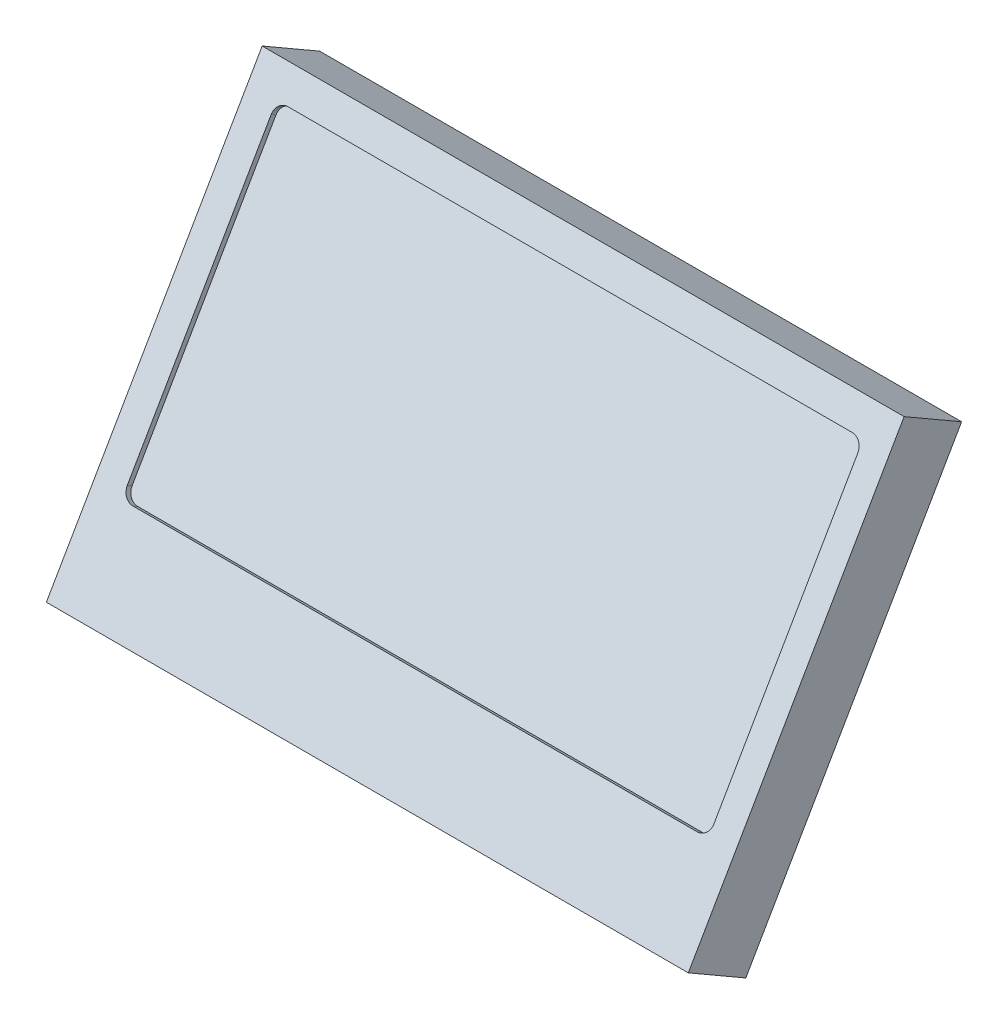
ISO-10303-21;
HEADER;
FILE_DESCRIPTION(('STEP AP214'),'2;1');
FILE_NAME('part.step','',(''),(''),'','','');
FILE_SCHEMA(('AUTOMOTIVE_DESIGN { 1 0 10303 214 1 1 1 1 }'));
ENDSEC;
DATA;
#1=APPLICATION_CONTEXT('core data for automotive mechanical design processes');
#2=APPLICATION_PROTOCOL_DEFINITION('international standard','automotive_design',2000,#1);
#3=PRODUCT_CONTEXT('',#1,'mechanical');
#4=PRODUCT('Part','Part','',(#3));
#5=PRODUCT_RELATED_PRODUCT_CATEGORY('part','',(#4));
#6=PRODUCT_DEFINITION_FORMATION('','',#4);
#7=PRODUCT_DEFINITION_CONTEXT('part definition',#1,'design');
#8=PRODUCT_DEFINITION('design','',#6,#7);
#9=PRODUCT_DEFINITION_SHAPE('','',#8);
#10=(LENGTH_UNIT() NAMED_UNIT(*) SI_UNIT(.MILLI.,.METRE.));
#11=(NAMED_UNIT(*) PLANE_ANGLE_UNIT() SI_UNIT($,.RADIAN.));
#12=(NAMED_UNIT(*) SI_UNIT($,.STERADIAN.) SOLID_ANGLE_UNIT());
#13=UNCERTAINTY_MEASURE_WITH_UNIT(LENGTH_MEASURE(1.E-05),#10,'distance_accuracy_value','');
#14=(GEOMETRIC_REPRESENTATION_CONTEXT(3) GLOBAL_UNCERTAINTY_ASSIGNED_CONTEXT((#13)) GLOBAL_UNIT_ASSIGNED_CONTEXT((#10,
#11,#12)) REPRESENTATION_CONTEXT('',''));
#15=CARTESIAN_POINT('',(0.,0.,0.));
#16=DIRECTION('',(0.,0.,1.));
#17=DIRECTION('',(1.,0.,0.));
#18=AXIS2_PLACEMENT_3D('',#15,#16,#17);
#19=CARTESIAN_POINT('',(42.625,36.0009193510513,16.1708302491977));
#20=DIRECTION('',(0.,-0.5,-0.866025403784439));
#21=DIRECTION('',(0.,0.866025403784439,-0.5));
#22=AXIS2_PLACEMENT_3D('',#19,#20,#21);
#23=PLANE('',#22);
#24=DIRECTION('',(1.,0.,0.));
#25=VECTOR('',#24,1.);
#26=CARTESIAN_POINT('',(69.125,23.8765636980692,23.1708302491977));
#27=LINE('',#26,#25);
#28=CARTESIAN_POINT('',(17.125,23.8765636980692,23.1708302491977));
#29=VERTEX_POINT('',#28);
#30=CARTESIAN_POINT('',(68.125,23.8765636980692,23.1708302491977));
#31=VERTEX_POINT('',#30);
#32=EDGE_CURVE('E165',#29,#31,#27,.T.);
#33=ORIENTED_EDGE('',*,*,#32,.T.);
#34=CARTESIAN_POINT('',(68.125,24.7425891018536,22.6708302491977));
#35=DIRECTION('',(0.,-0.5,-0.866025403784439));
#36=DIRECTION('',(0.,0.866025403784439,-0.5));
#37=AXIS2_PLACEMENT_3D('',#34,#35,#36);
#38=CIRCLE('',#37,1.);
#39=CARTESIAN_POINT('',(69.125,24.7425891018536,22.6708302491977));
#40=VERTEX_POINT('',#39);
#41=EDGE_CURVE('E129',#31,#40,#38,.F.);
#42=ORIENTED_EDGE('',*,*,#41,.T.);
#43=DIRECTION('',(0.,0.866025403784439,-0.5));
#44=VECTOR('',#43,1.);
#45=CARTESIAN_POINT('',(69.125,24.7425891018536,22.6708302491977));
#46=LINE('',#45,#44);
#47=CARTESIAN_POINT('',(69.125,47.259249600249,9.6708302491977));
#48=VERTEX_POINT('',#47);
#49=EDGE_CURVE('E126',#40,#48,#46,.T.);
#50=ORIENTED_EDGE('',*,*,#49,.T.);
#51=CARTESIAN_POINT('',(68.125,47.259249600249,9.6708302491977));
#52=DIRECTION('',(0.,-0.5,-0.866025403784439));
#53=DIRECTION('',(0.,0.866025403784439,-0.5));
#54=AXIS2_PLACEMENT_3D('',#51,#52,#53);
#55=CIRCLE('',#54,1.);
#56=CARTESIAN_POINT('',(68.125,48.1252750040335,9.17083024919768));
#57=VERTEX_POINT('',#56);
#58=EDGE_CURVE('E20',#57,#48,#55,.T.);
#59=ORIENTED_EDGE('',*,*,#58,.F.);
#60=DIRECTION('',(1.,0.,0.));
#61=VECTOR('',#60,1.);
#62=CARTESIAN_POINT('',(16.125,48.1252750040335,9.17083024919766));
#63=LINE('',#62,#61);
#64=CARTESIAN_POINT('',(17.125,48.1252750040335,9.17083024919766));
#65=VERTEX_POINT('',#64);
#66=EDGE_CURVE('E146',#57,#65,#63,.F.);
#67=ORIENTED_EDGE('',*,*,#66,.T.);
#68=CARTESIAN_POINT('',(17.125,47.259249600249,9.67083024919768));
#69=DIRECTION('',(0.,-0.5,-0.866025403784439));
#70=DIRECTION('',(0.,0.866025403784439,-0.5));
#71=AXIS2_PLACEMENT_3D('',#68,#69,#70);
#72=CIRCLE('',#71,1.);
#73=CARTESIAN_POINT('',(16.125,47.259249600249,9.67083024919769));
#74=VERTEX_POINT('',#73);
#75=EDGE_CURVE('E150',#65,#74,#72,.F.);
#76=ORIENTED_EDGE('',*,*,#75,.T.);
#77=DIRECTION('',(0.,-0.866025403784439,0.5));
#78=VECTOR('',#77,1.);
#79=CARTESIAN_POINT('',(16.125,47.259249600249,9.67083024919771));
#80=LINE('',#79,#78);
#81=CARTESIAN_POINT('',(16.125,24.7425891018536,22.6708302491977));
#82=VERTEX_POINT('',#81);
#83=EDGE_CURVE('E155',#74,#82,#80,.T.);
#84=ORIENTED_EDGE('',*,*,#83,.T.);
#85=CARTESIAN_POINT('',(17.125,24.7425891018536,22.6708302491977));
#86=DIRECTION('',(0.,-0.5,-0.866025403784439));
#87=DIRECTION('',(0.,0.866025403784439,-0.5));
#88=AXIS2_PLACEMENT_3D('',#85,#86,#87);
#89=CIRCLE('',#88,1.);
#90=EDGE_CURVE('E160',#82,#29,#89,.F.);
#91=ORIENTED_EDGE('',*,*,#90,.T.);
#92=EDGE_LOOP('',(#33,#42,#50,#59,#67,#76,#84,#91));
#93=FACE_BOUND('',#92,.T.);
#94=ADVANCED_FACE('F17',(#93),#23,.F.);
#95=CARTESIAN_POINT('',(69.125,48.3752750040335,9.60384295108993));
#96=DIRECTION('',(1.,0.,0.));
#97=DIRECTION('',(0.,0.,-1.));
#98=AXIS2_PLACEMENT_3D('',#95,#96,#97);
#99=PLANE('',#98);
#100=ORIENTED_EDGE('',*,*,#49,.F.);
#101=DIRECTION('',(0.,-0.5,-0.866025403784439));
#102=VECTOR('',#101,1.);
#103=CARTESIAN_POINT('',(69.125,24.9925891018536,23.1038429510899));
#104=LINE('',#103,#102);
#105=CARTESIAN_POINT('',(69.125,24.9925891018536,23.1038429510899));
#106=VERTEX_POINT('',#105);
#107=EDGE_CURVE('E133',#40,#106,#104,.F.);
#108=ORIENTED_EDGE('',*,*,#107,.T.);
#109=DIRECTION('',(0.,-0.866025403784439,0.5));
#110=VECTOR('',#109,1.);
#111=CARTESIAN_POINT('',(69.125,33.761096315171,18.0413429510899));
#112=LINE('',#111,#110);
#113=CARTESIAN_POINT('',(69.125,47.509249600249,10.1038429510899));
#114=VERTEX_POINT('',#113);
#115=EDGE_CURVE('E137',#114,#106,#112,.T.);
#116=ORIENTED_EDGE('',*,*,#115,.F.);
#117=DIRECTION('',(0.,-0.5,-0.866025403784439));
#118=VECTOR('',#117,1.);
#119=CARTESIAN_POINT('',(69.125,47.509249600249,10.1038429510899));
#120=LINE('',#119,#118);
#121=EDGE_CURVE('E122',#114,#48,#120,.T.);
#122=ORIENTED_EDGE('',*,*,#121,.T.);
#123=EDGE_LOOP('',(#100,#108,#116,#122));
#124=FACE_BOUND('',#123,.T.);
#125=ADVANCED_FACE('F136',(#124),#99,.F.);
#126=CARTESIAN_POINT('',(68.125,24.9925891018536,23.1038429510899));
#127=DIRECTION('',(0.,-0.5,-0.866025403784439));
#128=DIRECTION('',(0.,0.866025403784439,-0.5));
#129=AXIS2_PLACEMENT_3D('',#126,#127,#128);
#130=CYLINDRICAL_SURFACE('',#129,1.);
#131=DIRECTION('',(0.,-0.5,-0.866025403784439));
#132=VECTOR('',#131,1.);
#133=CARTESIAN_POINT('',(68.125,24.1265636980692,23.6038429510899));
#134=LINE('',#133,#132);
#135=CARTESIAN_POINT('',(68.125,24.1265636980692,23.6038429510899));
#136=VERTEX_POINT('',#135);
#137=EDGE_CURVE('E161',#31,#136,#134,.F.);
#138=ORIENTED_EDGE('',*,*,#137,.T.);
#139=CARTESIAN_POINT('',(68.125,24.9925891018536,23.1038429510899));
#140=DIRECTION('',(0.,-0.5,-0.866025403784439));
#141=DIRECTION('',(0.,0.866025403784439,-0.5));
#142=AXIS2_PLACEMENT_3D('',#139,#140,#141);
#143=CIRCLE('',#142,1.);
#144=EDGE_CURVE('E139',#106,#136,#143,.T.);
#145=ORIENTED_EDGE('',*,*,#144,.F.);
#146=ORIENTED_EDGE('',*,*,#107,.F.);
#147=ORIENTED_EDGE('',*,*,#41,.F.);
#148=EDGE_LOOP('',(#138,#145,#146,#147));
#149=FACE_BOUND('',#148,.T.);
#150=ADVANCED_FACE('F257',(#149),#130,.F.);
#151=CARTESIAN_POINT('',(69.125,24.1265636980692,23.6038429510899));
#152=DIRECTION('',(0.,-0.866025403784439,0.5));
#153=DIRECTION('',(0.,-0.5,-0.866025403784439));
#154=AXIS2_PLACEMENT_3D('',#151,#152,#153);
#155=PLANE('',#154);
#156=DIRECTION('',(1.,0.,0.));
#157=VECTOR('',#156,1.);
#158=CARTESIAN_POINT('',(42.5,24.1265636980692,23.6038429510899));
#159=LINE('',#158,#157);
#160=CARTESIAN_POINT('',(17.125,24.1265636980692,23.6038429510899));
#161=VERTEX_POINT('',#160);
#162=EDGE_CURVE('E184',#136,#161,#159,.F.);
#163=ORIENTED_EDGE('',*,*,#162,.F.);
#164=ORIENTED_EDGE('',*,*,#137,.F.);
#165=ORIENTED_EDGE('',*,*,#32,.F.);
#166=DIRECTION('',(0.,-0.5,-0.866025403784439));
#167=VECTOR('',#166,1.);
#168=CARTESIAN_POINT('',(17.125,24.1265636980692,23.6038429510899));
#169=LINE('',#168,#167);
#170=EDGE_CURVE('E156',#29,#161,#169,.F.);
#171=ORIENTED_EDGE('',*,*,#170,.T.);
#172=EDGE_LOOP('',(#163,#164,#165,#171));
#173=FACE_BOUND('',#172,.T.);
#174=ADVANCED_FACE('F254',(#173),#155,.F.);
#175=CARTESIAN_POINT('',(17.125,24.9925891018536,23.1038429510899));
#176=DIRECTION('',(0.,-0.5,-0.866025403784439));
#177=DIRECTION('',(0.,0.866025403784439,-0.5));
#178=AXIS2_PLACEMENT_3D('',#175,#176,#177);
#179=CYLINDRICAL_SURFACE('',#178,1.);
#180=DIRECTION('',(0.,0.500000000000017,0.866025403784429));
#181=VECTOR('',#180,1.);
#182=CARTESIAN_POINT('',(16.125,24.7425891018536,22.6708302491977));
#183=LINE('',#182,#181);
#184=CARTESIAN_POINT('',(16.125,24.9925891018536,23.1038429510899));
#185=VERTEX_POINT('',#184);
#186=EDGE_CURVE('E151',#82,#185,#183,.T.);
#187=ORIENTED_EDGE('',*,*,#186,.T.);
#188=CARTESIAN_POINT('',(17.125,24.9925891018536,23.1038429510899));
#189=DIRECTION('',(0.,-0.5,-0.866025403784439));
#190=DIRECTION('',(0.,0.866025403784439,-0.5));
#191=AXIS2_PLACEMENT_3D('',#188,#189,#190);
#192=CIRCLE('',#191,1.);
#193=EDGE_CURVE('E181',#161,#185,#192,.T.);
#194=ORIENTED_EDGE('',*,*,#193,.F.);
#195=ORIENTED_EDGE('',*,*,#170,.F.);
#196=ORIENTED_EDGE('',*,*,#90,.F.);
#197=EDGE_LOOP('',(#187,#194,#195,#196));
#198=FACE_BOUND('',#197,.T.);
#199=ADVANCED_FACE('F249',(#198),#179,.F.);
#200=CARTESIAN_POINT('',(16.125,24.1265636980692,23.6038429510899));
#201=DIRECTION('',(-1.,0.,0.));
#202=DIRECTION('',(0.,0.,1.));
#203=AXIS2_PLACEMENT_3D('',#200,#201,#202);
#204=PLANE('',#203);
#205=ORIENTED_EDGE('',*,*,#83,.F.);
#206=DIRECTION('',(0.,-0.5,-0.866025403784439));
#207=VECTOR('',#206,1.);
#208=CARTESIAN_POINT('',(16.125,47.509249600249,10.1038429510899));
#209=LINE('',#208,#207);
#210=CARTESIAN_POINT('',(16.125,47.509249600249,10.1038429510899));
#211=VERTEX_POINT('',#210);
#212=EDGE_CURVE('E147',#74,#211,#209,.F.);
#213=ORIENTED_EDGE('',*,*,#212,.T.);
#214=DIRECTION('',(0.,-0.866025403784439,0.5));
#215=VECTOR('',#214,1.);
#216=CARTESIAN_POINT('',(16.125,33.761096315171,18.0413429510899));
#217=LINE('',#216,#215);
#218=EDGE_CURVE('E180',#185,#211,#217,.F.);
#219=ORIENTED_EDGE('',*,*,#218,.F.);
#220=ORIENTED_EDGE('',*,*,#186,.F.);
#221=EDGE_LOOP('',(#205,#213,#219,#220));
#222=FACE_BOUND('',#221,.T.);
#223=ADVANCED_FACE('F245',(#222),#204,.F.);
#224=CARTESIAN_POINT('',(17.125,47.509249600249,10.1038429510899));
#225=DIRECTION('',(0.,-0.5,-0.866025403784439));
#226=DIRECTION('',(0.,0.866025403784439,-0.5));
#227=AXIS2_PLACEMENT_3D('',#224,#225,#226);
#228=CYLINDRICAL_SURFACE('',#227,1.);
#229=DIRECTION('',(0.,0.5,0.866025403784439));
#230=VECTOR('',#229,1.);
#231=CARTESIAN_POINT('',(17.125,48.3752750040335,9.60384295108993));
#232=LINE('',#231,#230);
#233=CARTESIAN_POINT('',(17.125,48.3752750040335,9.60384295108988));
#234=VERTEX_POINT('',#233);
#235=EDGE_CURVE('E141',#65,#234,#232,.T.);
#236=ORIENTED_EDGE('',*,*,#235,.T.);
#237=CARTESIAN_POINT('',(17.125,47.509249600249,10.1038429510899));
#238=DIRECTION('',(0.,-0.5,-0.866025403784439));
#239=DIRECTION('',(0.,0.866025403784439,-0.5));
#240=AXIS2_PLACEMENT_3D('',#237,#238,#239);
#241=CIRCLE('',#240,1.);
#242=EDGE_CURVE('E178',#211,#234,#241,.T.);
#243=ORIENTED_EDGE('',*,*,#242,.F.);
#244=ORIENTED_EDGE('',*,*,#212,.F.);
#245=ORIENTED_EDGE('',*,*,#75,.F.);
#246=EDGE_LOOP('',(#236,#243,#244,#245));
#247=FACE_BOUND('',#246,.T.);
#248=ADVANCED_FACE('F242',(#247),#228,.F.);
#249=CARTESIAN_POINT('',(16.125,48.3752750040335,9.60384295108993));
#250=DIRECTION('',(0.,0.866025403784439,-0.5));
#251=DIRECTION('',(0.,0.5,0.866025403784439));
#252=AXIS2_PLACEMENT_3D('',#249,#250,#251);
#253=PLANE('',#252);
#254=ORIENTED_EDGE('',*,*,#66,.F.);
#255=DIRECTION('',(0.,-0.5,-0.866025403784439));
#256=VECTOR('',#255,1.);
#257=CARTESIAN_POINT('',(68.125,48.3752750040334,9.6038429510899));
#258=LINE('',#257,#256);
#259=CARTESIAN_POINT('',(68.125,48.3752750040335,9.60384295108991));
#260=VERTEX_POINT('',#259);
#261=EDGE_CURVE('E125',#57,#260,#258,.F.);
#262=ORIENTED_EDGE('',*,*,#261,.T.);
#263=DIRECTION('',(1.,0.,0.));
#264=VECTOR('',#263,1.);
#265=CARTESIAN_POINT('',(42.5,48.3752750040335,9.60384295108987));
#266=LINE('',#265,#264);
#267=EDGE_CURVE('E177',#234,#260,#266,.T.);
#268=ORIENTED_EDGE('',*,*,#267,.F.);
#269=ORIENTED_EDGE('',*,*,#235,.F.);
#270=EDGE_LOOP('',(#254,#262,#268,#269));
#271=FACE_BOUND('',#270,.T.);
#272=ADVANCED_FACE('F239',(#271),#253,.F.);
#273=CARTESIAN_POINT('',(68.125,47.509249600249,10.1038429510899));
#274=DIRECTION('',(0.,-0.5,-0.866025403784439));
#275=DIRECTION('',(0.,0.866025403784439,-0.5));
#276=AXIS2_PLACEMENT_3D('',#273,#274,#275);
#277=CYLINDRICAL_SURFACE('',#276,1.);
#278=ORIENTED_EDGE('',*,*,#121,.F.);
#279=CARTESIAN_POINT('',(68.125,47.509249600249,10.1038429510899));
#280=DIRECTION('',(0.,-0.5,-0.866025403784439));
#281=DIRECTION('',(0.,0.866025403784439,-0.5));
#282=AXIS2_PLACEMENT_3D('',#279,#280,#281);
#283=CIRCLE('',#282,1.);
#284=EDGE_CURVE('E174',#260,#114,#283,.T.);
#285=ORIENTED_EDGE('',*,*,#284,.F.);
#286=ORIENTED_EDGE('',*,*,#261,.F.);
#287=ORIENTED_EDGE('',*,*,#58,.T.);
#288=EDGE_LOOP('',(#278,#285,#286,#287));
#289=FACE_BOUND('',#288,.T.);
#290=ADVANCED_FACE('F119',(#289),#277,.F.);
#291=CARTESIAN_POINT('',(42.5,33.761096315171,18.0413429510899));
#292=DIRECTION('',(0.,0.5,0.866025403784439));
#293=DIRECTION('',(0.,-0.866025403784439,0.5));
#294=AXIS2_PLACEMENT_3D('',#291,#292,#293);
#295=PLANE('',#294);
#296=ORIENTED_EDGE('',*,*,#267,.T.);
#297=ORIENTED_EDGE('',*,*,#284,.T.);
#298=ORIENTED_EDGE('',*,*,#115,.T.);
#299=ORIENTED_EDGE('',*,*,#144,.T.);
#300=ORIENTED_EDGE('',*,*,#162,.T.);
#301=ORIENTED_EDGE('',*,*,#193,.T.);
#302=ORIENTED_EDGE('',*,*,#218,.T.);
#303=ORIENTED_EDGE('',*,*,#242,.T.);
#304=EDGE_LOOP('',(#296,#297,#298,#299,#300,#301,#302,#303));
#305=FACE_BOUND('',#304,.T.);
#306=DIRECTION('',(0.,0.866025403784439,-0.5));
#307=VECTOR('',#306,1.);
#308=CARTESIAN_POINT('',(13.5,16.8736009413745,27.7913429510899));
#309=LINE('',#308,#307);
#310=CARTESIAN_POINT('',(13.5,16.8736009413745,27.7913429510899));
#311=VERTEX_POINT('',#310);
#312=CARTESIAN_POINT('',(13.5,50.6485916889676,8.29134295108991));
#313=VERTEX_POINT('',#312);
#314=EDGE_CURVE('E213',#311,#313,#309,.T.);
#315=ORIENTED_EDGE('',*,*,#314,.F.);
#316=DIRECTION('',(1.,0.,0.));
#317=VECTOR('',#316,1.);
#318=CARTESIAN_POINT('',(13.5,16.8736009413745,27.7913429510899));
#319=LINE('',#318,#317);
#320=CARTESIAN_POINT('',(71.5,16.8736009413745,27.7913429510899));
#321=VERTEX_POINT('',#320);
#322=EDGE_CURVE('E202',#321,#311,#319,.F.);
#323=ORIENTED_EDGE('',*,*,#322,.F.);
#324=DIRECTION('',(0.,-0.866025403784439,0.5));
#325=VECTOR('',#324,1.);
#326=CARTESIAN_POINT('',(71.5,50.6485916889676,8.29134295108992));
#327=LINE('',#326,#325);
#328=CARTESIAN_POINT('',(71.5,50.6485916889676,8.29134295108991));
#329=VERTEX_POINT('',#328);
#330=EDGE_CURVE('E198',#329,#321,#327,.T.);
#331=ORIENTED_EDGE('',*,*,#330,.F.);
#332=DIRECTION('',(1.,0.,0.));
#333=VECTOR('',#332,1.);
#334=CARTESIAN_POINT('',(71.5,50.6485916889676,8.29134295108992));
#335=LINE('',#334,#333);
#336=EDGE_CURVE('E176',#313,#329,#335,.T.);
#337=ORIENTED_EDGE('',*,*,#336,.F.);
#338=EDGE_LOOP('',(#315,#323,#331,#337));
#339=FACE_BOUND('',#338,.T.);
#340=ADVANCED_FACE('F234',(#305,#339),#295,.T.);
#341=CARTESIAN_POINT('',(71.5,47.6485916889676,3.09519052838329));
#342=DIRECTION('',(0.,0.866025403784439,-0.5));
#343=DIRECTION('',(0.,0.5,0.866025403784439));
#344=AXIS2_PLACEMENT_3D('',#341,#342,#343);
#345=PLANE('',#344);
#346=ORIENTED_EDGE('',*,*,#336,.T.);
#347=DIRECTION('',(0.,0.5,0.866025403784439));
#348=VECTOR('',#347,1.);
#349=CARTESIAN_POINT('',(71.5,47.6485916889676,3.09519052838329));
#350=LINE('',#349,#348);
#351=CARTESIAN_POINT('',(71.5,47.6485916889676,3.0951905283833));
#352=VERTEX_POINT('',#351);
#353=EDGE_CURVE('E217',#352,#329,#350,.T.);
#354=ORIENTED_EDGE('',*,*,#353,.F.);
#355=DIRECTION('',(1.,0.,0.));
#356=VECTOR('',#355,1.);
#357=CARTESIAN_POINT('',(52.8749999999999,47.6485916889676,3.09519052838332));
#358=LINE('',#357,#356);
#359=CARTESIAN_POINT('',(13.5,47.6485916889676,3.0951905283833));
#360=VERTEX_POINT('',#359);
#361=EDGE_CURVE('E197',#352,#360,#358,.F.);
#362=ORIENTED_EDGE('',*,*,#361,.T.);
#363=DIRECTION('',(0.,-0.5,-0.866025403784439));
#364=VECTOR('',#363,1.);
#365=CARTESIAN_POINT('',(13.5,50.6485916889676,8.29134295108992));
#366=LINE('',#365,#364);
#367=EDGE_CURVE('E205',#313,#360,#366,.T.);
#368=ORIENTED_EDGE('',*,*,#367,.F.);
#369=EDGE_LOOP('',(#346,#354,#362,#368));
#370=FACE_BOUND('',#369,.T.);
#371=ADVANCED_FACE('F284',(#370),#345,.T.);
#372=CARTESIAN_POINT('',(13.5,47.6485916889676,3.09519052838329));
#373=DIRECTION('',(-1.,0.,0.));
#374=DIRECTION('',(0.,0.,1.));
#375=AXIS2_PLACEMENT_3D('',#372,#373,#374);
#376=PLANE('',#375);
#377=ORIENTED_EDGE('',*,*,#314,.T.);
#378=ORIENTED_EDGE('',*,*,#367,.T.);
#379=DIRECTION('',(0.,-0.866025403784439,0.5));
#380=VECTOR('',#379,1.);
#381=CARTESIAN_POINT('',(13.5,29.8442066707183,13.3745570114253));
#382=LINE('',#381,#380);
#383=CARTESIAN_POINT('',(13.5,13.8736009413745,22.5951905283833));
#384=VERTEX_POINT('',#383);
#385=EDGE_CURVE('E208',#360,#384,#382,.T.);
#386=ORIENTED_EDGE('',*,*,#385,.T.);
#387=DIRECTION('',(0.,-0.5,-0.866025403784439));
#388=VECTOR('',#387,1.);
#389=CARTESIAN_POINT('',(13.5,13.8736009413745,22.5951905283833));
#390=LINE('',#389,#388);
#391=EDGE_CURVE('E204',#311,#384,#390,.T.);
#392=ORIENTED_EDGE('',*,*,#391,.F.);
#393=EDGE_LOOP('',(#377,#378,#386,#392));
#394=FACE_BOUND('',#393,.T.);
#395=ADVANCED_FACE('F280',(#394),#376,.T.);
#396=CARTESIAN_POINT('',(13.5,13.8736009413745,22.5951905283833));
#397=DIRECTION('',(0.,-0.866025403784439,0.5));
#398=DIRECTION('',(0.,-0.5,-0.866025403784439));
#399=AXIS2_PLACEMENT_3D('',#396,#397,#398);
#400=PLANE('',#399);
#401=ORIENTED_EDGE('',*,*,#322,.T.);
#402=ORIENTED_EDGE('',*,*,#391,.T.);
#403=DIRECTION('',(1.,0.,0.));
#404=VECTOR('',#403,1.);
#405=CARTESIAN_POINT('',(52.8749999999999,13.8736009413745,22.5951905283833));
#406=LINE('',#405,#404);
#407=CARTESIAN_POINT('',(71.5,13.8736009413745,22.5951905283833));
#408=VERTEX_POINT('',#407);
#409=EDGE_CURVE('E26',#384,#408,#406,.T.);
#410=ORIENTED_EDGE('',*,*,#409,.T.);
#411=DIRECTION('',(0.,-0.500000000000003,-0.866025403784437));
#412=VECTOR('',#411,1.);
#413=CARTESIAN_POINT('',(71.5,16.8736009413745,27.7913429510899));
#414=LINE('',#413,#412);
#415=EDGE_CURVE('E38',#321,#408,#414,.T.);
#416=ORIENTED_EDGE('',*,*,#415,.F.);
#417=EDGE_LOOP('',(#401,#402,#410,#416));
#418=FACE_BOUND('',#417,.T.);
#419=ADVANCED_FACE('F274',(#418),#400,.T.);
#420=CARTESIAN_POINT('',(71.5,13.8736009413745,22.5951905283833));
#421=DIRECTION('',(1.,0.,0.));
#422=DIRECTION('',(0.,0.,-1.));
#423=AXIS2_PLACEMENT_3D('',#420,#421,#422);
#424=PLANE('',#423);
#425=ORIENTED_EDGE('',*,*,#330,.T.);
#426=ORIENTED_EDGE('',*,*,#415,.T.);
#427=DIRECTION('',(0.,-0.866025403784439,0.5));
#428=VECTOR('',#427,1.);
#429=CARTESIAN_POINT('',(71.5,29.8442066707183,13.3745570114253));
#430=LINE('',#429,#428);
#431=EDGE_CURVE('E11',#408,#352,#430,.F.);
#432=ORIENTED_EDGE('',*,*,#431,.T.);
#433=ORIENTED_EDGE('',*,*,#353,.T.);
#434=EDGE_LOOP('',(#425,#426,#432,#433));
#435=FACE_BOUND('',#434,.T.);
#436=ADVANCED_FACE('F268',(#435),#424,.T.);
#437=CARTESIAN_POINT('',(52.8749999999999,29.8442066707183,13.3745570114253));
#438=DIRECTION('',(0.,0.5,0.866025403784439));
#439=DIRECTION('',(0.,-0.866025403784439,0.5));
#440=AXIS2_PLACEMENT_3D('',#437,#438,#439);
#441=PLANE('',#440);
#442=ORIENTED_EDGE('',*,*,#409,.F.);
#443=ORIENTED_EDGE('',*,*,#385,.F.);
#444=ORIENTED_EDGE('',*,*,#361,.F.);
#445=ORIENTED_EDGE('',*,*,#431,.F.);
#446=EDGE_LOOP('',(#442,#443,#444,#445));
#447=FACE_BOUND('',#446,.T.);
#448=ADVANCED_FACE('F266',(#447),#441,.F.);
#449=CLOSED_SHELL('',(#94,#125,#150,#174,#199,#223,#248,#272,#290,#340,#371,#395,#419,#436,#448));
#450=MANIFOLD_SOLID_BREP('B1',#449);
#451=ADVANCED_BREP_SHAPE_REPRESENTATION('',(#18,#450),#14);
#452=SHAPE_DEFINITION_REPRESENTATION(#9,#451);
ENDSEC;
END-ISO-10303-21;
